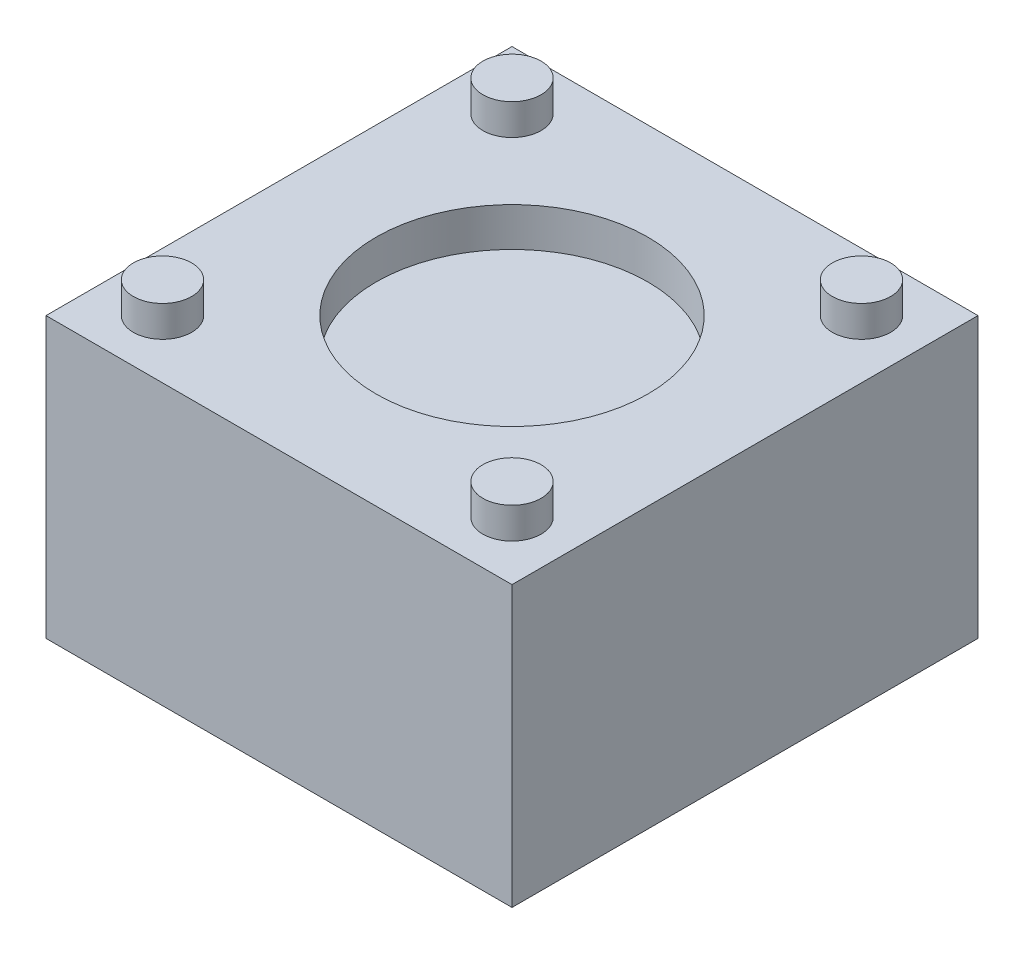
ISO-10303-21;
HEADER;
FILE_DESCRIPTION(('STEP AP214'),'2;1');
FILE_NAME('part.step','',(''),(''),'','','');
FILE_SCHEMA(('AUTOMOTIVE_DESIGN { 1 0 10303 214 1 1 1 1 }'));
ENDSEC;
DATA;
#1=APPLICATION_CONTEXT('core data for automotive mechanical design processes');
#2=APPLICATION_PROTOCOL_DEFINITION('international standard','automotive_design',2000,#1);
#3=PRODUCT_CONTEXT('',#1,'mechanical');
#4=PRODUCT('Part','Part','',(#3));
#5=PRODUCT_RELATED_PRODUCT_CATEGORY('part','',(#4));
#6=PRODUCT_DEFINITION_FORMATION('','',#4);
#7=PRODUCT_DEFINITION_CONTEXT('part definition',#1,'design');
#8=PRODUCT_DEFINITION('design','',#6,#7);
#9=PRODUCT_DEFINITION_SHAPE('','',#8);
#10=(LENGTH_UNIT() NAMED_UNIT(*) SI_UNIT(.MILLI.,.METRE.));
#11=(NAMED_UNIT(*) PLANE_ANGLE_UNIT() SI_UNIT($,.RADIAN.));
#12=(NAMED_UNIT(*) SI_UNIT($,.STERADIAN.) SOLID_ANGLE_UNIT());
#13=UNCERTAINTY_MEASURE_WITH_UNIT(LENGTH_MEASURE(1.E-05),#10,'distance_accuracy_value','');
#14=(GEOMETRIC_REPRESENTATION_CONTEXT(3) GLOBAL_UNCERTAINTY_ASSIGNED_CONTEXT((#13)) GLOBAL_UNIT_ASSIGNED_CONTEXT((#10,
#11,#12)) REPRESENTATION_CONTEXT('',''));
#15=CARTESIAN_POINT('',(0.,0.,0.));
#16=DIRECTION('',(0.,0.,1.));
#17=DIRECTION('',(1.,0.,0.));
#18=AXIS2_PLACEMENT_3D('',#15,#16,#17);
#19=CARTESIAN_POINT('',(0.,4.,0.));
#20=DIRECTION('',(0.,1.,0.));
#21=DIRECTION('',(0.,0.,1.));
#22=AXIS2_PLACEMENT_3D('',#19,#20,#21);
#23=PLANE('',#22);
#24=CARTESIAN_POINT('',(2.25,4.,-2.25));
#25=DIRECTION('',(0.,1.,0.));
#26=DIRECTION('',(0.,0.,1.));
#27=AXIS2_PLACEMENT_3D('',#24,#25,#26);
#28=CIRCLE('',#27,0.375);
#29=CARTESIAN_POINT('',(2.25,4.,-1.875));
#30=VERTEX_POINT('',#29);
#31=EDGE_CURVE('E19',#30,#30,#28,.F.);
#32=ORIENTED_EDGE('',*,*,#31,.F.);
#33=EDGE_LOOP('',(#32));
#34=FACE_BOUND('',#33,.T.);
#35=ADVANCED_FACE('F16',(#34),#23,.T.);
#36=CARTESIAN_POINT('',(0.,4.,0.));
#37=DIRECTION('',(0.,1.,0.));
#38=DIRECTION('',(0.,0.,1.));
#39=AXIS2_PLACEMENT_3D('',#36,#37,#38);
#40=PLANE('',#39);
#41=CARTESIAN_POINT('',(2.25,4.,2.25));
#42=DIRECTION('',(0.,1.,0.));
#43=DIRECTION('',(0.,0.,1.));
#44=AXIS2_PLACEMENT_3D('',#41,#42,#43);
#45=CIRCLE('',#44,0.375);
#46=CARTESIAN_POINT('',(2.25,4.,2.625));
#47=VERTEX_POINT('',#46);
#48=EDGE_CURVE('E103',#47,#47,#45,.F.);
#49=ORIENTED_EDGE('',*,*,#48,.F.);
#50=EDGE_LOOP('',(#49));
#51=FACE_BOUND('',#50,.T.);
#52=ADVANCED_FACE('F114',(#51),#40,.T.);
#53=CARTESIAN_POINT('',(0.,4.,0.));
#54=DIRECTION('',(0.,1.,0.));
#55=DIRECTION('',(0.,0.,1.));
#56=AXIS2_PLACEMENT_3D('',#53,#54,#55);
#57=PLANE('',#56);
#58=CARTESIAN_POINT('',(-2.25,4.,-2.25));
#59=DIRECTION('',(0.,1.,0.));
#60=DIRECTION('',(0.,0.,1.));
#61=AXIS2_PLACEMENT_3D('',#58,#59,#60);
#62=CIRCLE('',#61,0.375);
#63=CARTESIAN_POINT('',(-2.25,4.,-1.875));
#64=VERTEX_POINT('',#63);
#65=EDGE_CURVE('E101',#64,#64,#62,.F.);
#66=ORIENTED_EDGE('',*,*,#65,.F.);
#67=EDGE_LOOP('',(#66));
#68=FACE_BOUND('',#67,.T.);
#69=ADVANCED_FACE('F119',(#68),#57,.T.);
#70=CARTESIAN_POINT('',(0.,4.,0.));
#71=DIRECTION('',(0.,1.,0.));
#72=DIRECTION('',(0.,0.,1.));
#73=AXIS2_PLACEMENT_3D('',#70,#71,#72);
#74=PLANE('',#73);
#75=CARTESIAN_POINT('',(-2.25,4.,2.25));
#76=DIRECTION('',(0.,1.,0.));
#77=DIRECTION('',(0.,0.,1.));
#78=AXIS2_PLACEMENT_3D('',#75,#76,#77);
#79=CIRCLE('',#78,0.375);
#80=CARTESIAN_POINT('',(-2.25,4.,2.625));
#81=VERTEX_POINT('',#80);
#82=EDGE_CURVE('E98',#81,#81,#79,.F.);
#83=ORIENTED_EDGE('',*,*,#82,.F.);
#84=EDGE_LOOP('',(#83));
#85=FACE_BOUND('',#84,.T.);
#86=ADVANCED_FACE('F163',(#85),#74,.T.);
#87=CARTESIAN_POINT('',(0.,3.1,0.));
#88=DIRECTION('',(0.,1.,0.));
#89=DIRECTION('',(0.,0.,1.));
#90=AXIS2_PLACEMENT_3D('',#87,#88,#89);
#91=PLANE('',#90);
#92=CARTESIAN_POINT('',(0.,3.1,0.));
#93=DIRECTION('',(0.,1.,0.));
#94=DIRECTION('',(0.,0.,1.));
#95=AXIS2_PLACEMENT_3D('',#92,#93,#94);
#96=CIRCLE('',#95,1.75);
#97=CARTESIAN_POINT('',(0.,3.1,1.75));
#98=VERTEX_POINT('',#97);
#99=EDGE_CURVE('E95',#98,#98,#96,.T.);
#100=ORIENTED_EDGE('',*,*,#99,.T.);
#101=EDGE_LOOP('',(#100));
#102=FACE_BOUND('',#101,.T.);
#103=ADVANCED_FACE('F160',(#102),#91,.T.);
#104=CARTESIAN_POINT('',(2.25,3.6,-2.25));
#105=DIRECTION('',(0.,1.,0.));
#106=DIRECTION('',(0.,0.,1.));
#107=AXIS2_PLACEMENT_3D('',#104,#105,#106);
#108=CYLINDRICAL_SURFACE('',#107,0.375);
#109=ORIENTED_EDGE('',*,*,#31,.T.);
#110=EDGE_LOOP('',(#109));
#111=FACE_BOUND('',#110,.T.);
#112=CARTESIAN_POINT('',(2.25,3.6,-2.25));
#113=DIRECTION('',(0.,1.,0.));
#114=DIRECTION('',(0.,0.,1.));
#115=AXIS2_PLACEMENT_3D('',#112,#113,#114);
#116=CIRCLE('',#115,0.375);
#117=CARTESIAN_POINT('',(2.25,3.6,-1.875));
#118=VERTEX_POINT('',#117);
#119=EDGE_CURVE('E92',#118,#118,#116,.F.);
#120=ORIENTED_EDGE('',*,*,#119,.F.);
#121=EDGE_LOOP('',(#120));
#122=FACE_BOUND('',#121,.T.);
#123=ADVANCED_FACE('F110',(#111,#122),#108,.T.);
#124=CARTESIAN_POINT('',(2.25,3.6,2.25));
#125=DIRECTION('',(0.,1.,0.));
#126=DIRECTION('',(0.,0.,1.));
#127=AXIS2_PLACEMENT_3D('',#124,#125,#126);
#128=CYLINDRICAL_SURFACE('',#127,0.375);
#129=ORIENTED_EDGE('',*,*,#48,.T.);
#130=EDGE_LOOP('',(#129));
#131=FACE_BOUND('',#130,.T.);
#132=CARTESIAN_POINT('',(2.25,3.6,2.25));
#133=DIRECTION('',(0.,1.,0.));
#134=DIRECTION('',(0.,0.,1.));
#135=AXIS2_PLACEMENT_3D('',#132,#133,#134);
#136=CIRCLE('',#135,0.375);
#137=CARTESIAN_POINT('',(2.25,3.6,2.625));
#138=VERTEX_POINT('',#137);
#139=EDGE_CURVE('E89',#138,#138,#136,.F.);
#140=ORIENTED_EDGE('',*,*,#139,.F.);
#141=EDGE_LOOP('',(#140));
#142=FACE_BOUND('',#141,.T.);
#143=ADVANCED_FACE('F154',(#131,#142),#128,.T.);
#144=CARTESIAN_POINT('',(-2.25,3.6,-2.25));
#145=DIRECTION('',(0.,1.,0.));
#146=DIRECTION('',(0.,0.,1.));
#147=AXIS2_PLACEMENT_3D('',#144,#145,#146);
#148=CYLINDRICAL_SURFACE('',#147,0.375);
#149=ORIENTED_EDGE('',*,*,#65,.T.);
#150=EDGE_LOOP('',(#149));
#151=FACE_BOUND('',#150,.T.);
#152=CARTESIAN_POINT('',(-2.25,3.6,-2.25));
#153=DIRECTION('',(0.,1.,0.));
#154=DIRECTION('',(0.,0.,1.));
#155=AXIS2_PLACEMENT_3D('',#152,#153,#154);
#156=CIRCLE('',#155,0.375);
#157=CARTESIAN_POINT('',(-2.25,3.6,-1.875));
#158=VERTEX_POINT('',#157);
#159=EDGE_CURVE('E86',#158,#158,#156,.F.);
#160=ORIENTED_EDGE('',*,*,#159,.F.);
#161=EDGE_LOOP('',(#160));
#162=FACE_BOUND('',#161,.T.);
#163=ADVANCED_FACE('F150',(#151,#162),#148,.T.);
#164=CARTESIAN_POINT('',(-2.25,3.6,2.25));
#165=DIRECTION('',(0.,1.,0.));
#166=DIRECTION('',(0.,0.,1.));
#167=AXIS2_PLACEMENT_3D('',#164,#165,#166);
#168=CYLINDRICAL_SURFACE('',#167,0.375);
#169=ORIENTED_EDGE('',*,*,#82,.T.);
#170=EDGE_LOOP('',(#169));
#171=FACE_BOUND('',#170,.T.);
#172=CARTESIAN_POINT('',(-2.25,3.6,2.25));
#173=DIRECTION('',(0.,1.,0.));
#174=DIRECTION('',(0.,0.,1.));
#175=AXIS2_PLACEMENT_3D('',#172,#173,#174);
#176=CIRCLE('',#175,0.375);
#177=CARTESIAN_POINT('',(-2.25,3.6,2.625));
#178=VERTEX_POINT('',#177);
#179=EDGE_CURVE('E83',#178,#178,#176,.F.);
#180=ORIENTED_EDGE('',*,*,#179,.F.);
#181=EDGE_LOOP('',(#180));
#182=FACE_BOUND('',#181,.T.);
#183=ADVANCED_FACE('F146',(#171,#182),#168,.T.);
#184=CARTESIAN_POINT('',(0.,3.6,0.));
#185=DIRECTION('',(0.,1.,0.));
#186=DIRECTION('',(0.,0.,1.));
#187=AXIS2_PLACEMENT_3D('',#184,#185,#186);
#188=CYLINDRICAL_SURFACE('',#187,1.75);
#189=ORIENTED_EDGE('',*,*,#99,.F.);
#190=EDGE_LOOP('',(#189));
#191=FACE_BOUND('',#190,.T.);
#192=CARTESIAN_POINT('',(0.,3.6,0.));
#193=DIRECTION('',(0.,1.,0.));
#194=DIRECTION('',(0.,0.,1.));
#195=AXIS2_PLACEMENT_3D('',#192,#193,#194);
#196=CIRCLE('',#195,1.75);
#197=CARTESIAN_POINT('',(0.,3.6,1.75));
#198=VERTEX_POINT('',#197);
#199=EDGE_CURVE('E66',#198,#198,#196,.F.);
#200=ORIENTED_EDGE('',*,*,#199,.F.);
#201=EDGE_LOOP('',(#200));
#202=FACE_BOUND('',#201,.T.);
#203=ADVANCED_FACE('F143',(#191,#202),#188,.F.);
#204=CARTESIAN_POINT('',(0.,3.6,0.));
#205=DIRECTION('',(0.,1.,0.));
#206=DIRECTION('',(0.,0.,1.));
#207=AXIS2_PLACEMENT_3D('',#204,#205,#206);
#208=PLANE('',#207);
#209=DIRECTION('',(0.,0.,1.));
#210=VECTOR('',#209,1.);
#211=CARTESIAN_POINT('',(-3.,3.6,-3.));
#212=LINE('',#211,#210);
#213=CARTESIAN_POINT('',(-3.,3.6,3.));
#214=VERTEX_POINT('',#213);
#215=CARTESIAN_POINT('',(-3.,3.6,-3.));
#216=VERTEX_POINT('',#215);
#217=EDGE_CURVE('E288',#214,#216,#212,.F.);
#218=ORIENTED_EDGE('',*,*,#217,.F.);
#219=DIRECTION('',(1.,0.,0.));
#220=VECTOR('',#219,1.);
#221=CARTESIAN_POINT('',(-3.,3.6,3.));
#222=LINE('',#221,#220);
#223=CARTESIAN_POINT('',(3.,3.6,3.));
#224=VERTEX_POINT('',#223);
#225=EDGE_CURVE('E60',#224,#214,#222,.F.);
#226=ORIENTED_EDGE('',*,*,#225,.F.);
#227=DIRECTION('',(0.,0.,-1.));
#228=VECTOR('',#227,1.);
#229=CARTESIAN_POINT('',(3.,3.6,3.));
#230=LINE('',#229,#228);
#231=CARTESIAN_POINT('',(3.,3.6,-3.));
#232=VERTEX_POINT('',#231);
#233=EDGE_CURVE('E57',#232,#224,#230,.F.);
#234=ORIENTED_EDGE('',*,*,#233,.F.);
#235=DIRECTION('',(-1.,0.,0.));
#236=VECTOR('',#235,1.);
#237=CARTESIAN_POINT('',(3.,3.6,-3.));
#238=LINE('',#237,#236);
#239=EDGE_CURVE('E54',#216,#232,#238,.F.);
#240=ORIENTED_EDGE('',*,*,#239,.F.);
#241=EDGE_LOOP('',(#218,#226,#234,#240));
#242=FACE_BOUND('',#241,.T.);
#243=ORIENTED_EDGE('',*,*,#199,.T.);
#244=EDGE_LOOP('',(#243));
#245=FACE_BOUND('',#244,.T.);
#246=ORIENTED_EDGE('',*,*,#179,.T.);
#247=EDGE_LOOP('',(#246));
#248=FACE_BOUND('',#247,.T.);
#249=ORIENTED_EDGE('',*,*,#159,.T.);
#250=EDGE_LOOP('',(#249));
#251=FACE_BOUND('',#250,.T.);
#252=ORIENTED_EDGE('',*,*,#139,.T.);
#253=EDGE_LOOP('',(#252));
#254=FACE_BOUND('',#253,.T.);
#255=ORIENTED_EDGE('',*,*,#119,.T.);
#256=EDGE_LOOP('',(#255));
#257=FACE_BOUND('',#256,.T.);
#258=ADVANCED_FACE('F58',(#242,#245,#248,#251,#254,#257),#208,.T.);
#259=CARTESIAN_POINT('',(3.,0.,3.));
#260=DIRECTION('',(1.,0.,0.));
#261=DIRECTION('',(0.,0.,-1.));
#262=AXIS2_PLACEMENT_3D('',#259,#260,#261);
#263=PLANE('',#262);
#264=DIRECTION('',(0.,1.,0.));
#265=VECTOR('',#264,1.);
#266=CARTESIAN_POINT('',(3.,0.,-3.));
#267=LINE('',#266,#265);
#268=CARTESIAN_POINT('',(3.,0.,-3.));
#269=VERTEX_POINT('',#268);
#270=EDGE_CURVE('E65',#232,#269,#267,.F.);
#271=ORIENTED_EDGE('',*,*,#270,.F.);
#272=ORIENTED_EDGE('',*,*,#233,.T.);
#273=DIRECTION('',(0.,1.,0.));
#274=VECTOR('',#273,1.);
#275=CARTESIAN_POINT('',(3.,0.,3.));
#276=LINE('',#275,#274);
#277=CARTESIAN_POINT('',(3.,0.,3.));
#278=VERTEX_POINT('',#277);
#279=EDGE_CURVE('E289',#278,#224,#276,.T.);
#280=ORIENTED_EDGE('',*,*,#279,.F.);
#281=DIRECTION('',(0.,0.,1.));
#282=VECTOR('',#281,1.);
#283=CARTESIAN_POINT('',(3.,0.,0.));
#284=LINE('',#283,#282);
#285=EDGE_CURVE('E77',#278,#269,#284,.F.);
#286=ORIENTED_EDGE('',*,*,#285,.T.);
#287=EDGE_LOOP('',(#271,#272,#280,#286));
#288=FACE_BOUND('',#287,.T.);
#289=ADVANCED_FACE('F76',(#288),#263,.T.);
#290=CARTESIAN_POINT('',(3.,0.,-3.));
#291=DIRECTION('',(0.,0.,-1.));
#292=DIRECTION('',(-1.,0.,0.));
#293=AXIS2_PLACEMENT_3D('',#290,#291,#292);
#294=PLANE('',#293);
#295=DIRECTION('',(0.,1.,0.));
#296=VECTOR('',#295,1.);
#297=CARTESIAN_POINT('',(-3.,0.,-3.));
#298=LINE('',#297,#296);
#299=CARTESIAN_POINT('',(-3.,0.,-3.));
#300=VERTEX_POINT('',#299);
#301=EDGE_CURVE('E73',#216,#300,#298,.F.);
#302=ORIENTED_EDGE('',*,*,#301,.F.);
#303=ORIENTED_EDGE('',*,*,#239,.T.);
#304=ORIENTED_EDGE('',*,*,#270,.T.);
#305=DIRECTION('',(1.,0.,0.));
#306=VECTOR('',#305,1.);
#307=CARTESIAN_POINT('',(0.,0.,-3.));
#308=LINE('',#307,#306);
#309=EDGE_CURVE('E294',#269,#300,#308,.F.);
#310=ORIENTED_EDGE('',*,*,#309,.T.);
#311=EDGE_LOOP('',(#302,#303,#304,#310));
#312=FACE_BOUND('',#311,.T.);
#313=ADVANCED_FACE('F70',(#312),#294,.T.);
#314=CARTESIAN_POINT('',(-3.,0.,-3.));
#315=DIRECTION('',(-1.,0.,0.));
#316=DIRECTION('',(0.,0.,1.));
#317=AXIS2_PLACEMENT_3D('',#314,#315,#316);
#318=PLANE('',#317);
#319=DIRECTION('',(0.,1.,0.));
#320=VECTOR('',#319,1.);
#321=CARTESIAN_POINT('',(-3.,0.,3.));
#322=LINE('',#321,#320);
#323=CARTESIAN_POINT('',(-3.,0.,3.));
#324=VERTEX_POINT('',#323);
#325=EDGE_CURVE('E33',#214,#324,#322,.F.);
#326=ORIENTED_EDGE('',*,*,#325,.F.);
#327=ORIENTED_EDGE('',*,*,#217,.T.);
#328=ORIENTED_EDGE('',*,*,#301,.T.);
#329=DIRECTION('',(0.,0.,1.));
#330=VECTOR('',#329,1.);
#331=CARTESIAN_POINT('',(-3.,0.,0.));
#332=LINE('',#331,#330);
#333=EDGE_CURVE('E25',#300,#324,#332,.T.);
#334=ORIENTED_EDGE('',*,*,#333,.T.);
#335=EDGE_LOOP('',(#326,#327,#328,#334));
#336=FACE_BOUND('',#335,.T.);
#337=ADVANCED_FACE('F130',(#336),#318,.T.);
#338=CARTESIAN_POINT('',(-3.,0.,3.));
#339=DIRECTION('',(0.,0.,1.));
#340=DIRECTION('',(1.,0.,0.));
#341=AXIS2_PLACEMENT_3D('',#338,#339,#340);
#342=PLANE('',#341);
#343=ORIENTED_EDGE('',*,*,#279,.T.);
#344=ORIENTED_EDGE('',*,*,#225,.T.);
#345=ORIENTED_EDGE('',*,*,#325,.T.);
#346=DIRECTION('',(1.,0.,0.));
#347=VECTOR('',#346,1.);
#348=CARTESIAN_POINT('',(0.,0.,3.));
#349=LINE('',#348,#347);
#350=EDGE_CURVE('E11',#324,#278,#349,.T.);
#351=ORIENTED_EDGE('',*,*,#350,.T.);
#352=EDGE_LOOP('',(#343,#344,#345,#351));
#353=FACE_BOUND('',#352,.T.);
#354=ADVANCED_FACE('F123',(#353),#342,.T.);
#355=CARTESIAN_POINT('',(0.,0.,0.));
#356=DIRECTION('',(0.,1.,0.));
#357=DIRECTION('',(0.,0.,1.));
#358=AXIS2_PLACEMENT_3D('',#355,#356,#357);
#359=PLANE('',#358);
#360=ORIENTED_EDGE('',*,*,#333,.F.);
#361=ORIENTED_EDGE('',*,*,#309,.F.);
#362=ORIENTED_EDGE('',*,*,#285,.F.);
#363=ORIENTED_EDGE('',*,*,#350,.F.);
#364=EDGE_LOOP('',(#360,#361,#362,#363));
#365=FACE_BOUND('',#364,.T.);
#366=ADVANCED_FACE('F121',(#365),#359,.F.);
#367=CLOSED_SHELL('',(#35,#52,#69,#86,#103,#123,#143,#163,#183,#203,#258,#289,#313,#337,#354,#366));
#368=MANIFOLD_SOLID_BREP('B1',#367);
#369=ADVANCED_BREP_SHAPE_REPRESENTATION('',(#18,#368),#14);
#370=SHAPE_DEFINITION_REPRESENTATION(#9,#369);
ENDSEC;
END-ISO-10303-21;
